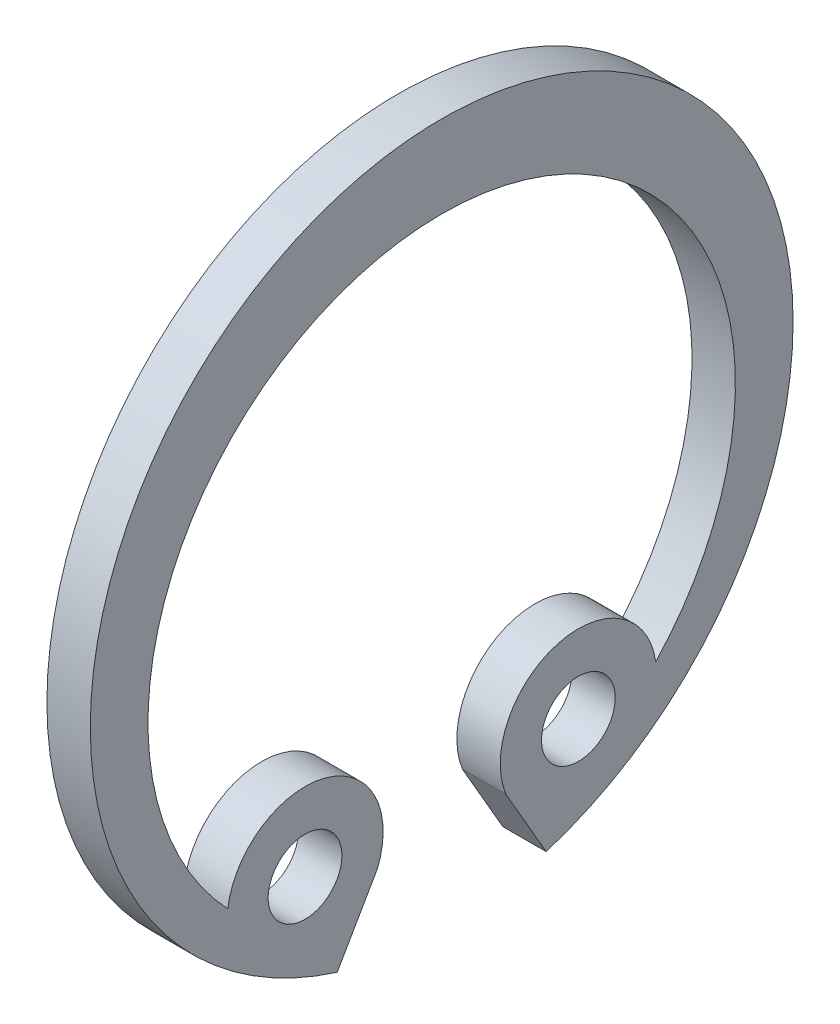
ISO-10303-21;
HEADER;
FILE_DESCRIPTION(('STEP AP214'),'2;1');
FILE_NAME('part.step','',(''),(''),'','','');
FILE_SCHEMA(('AUTOMOTIVE_DESIGN { 1 0 10303 214 1 1 1 1 }'));
ENDSEC;
DATA;
#1=APPLICATION_CONTEXT('core data for automotive mechanical design processes');
#2=APPLICATION_PROTOCOL_DEFINITION('international standard','automotive_design',2000,#1);
#3=PRODUCT_CONTEXT('',#1,'mechanical');
#4=PRODUCT('Part','Part','',(#3));
#5=PRODUCT_RELATED_PRODUCT_CATEGORY('part','',(#4));
#6=PRODUCT_DEFINITION_FORMATION('','',#4);
#7=PRODUCT_DEFINITION_CONTEXT('part definition',#1,'design');
#8=PRODUCT_DEFINITION('design','',#6,#7);
#9=PRODUCT_DEFINITION_SHAPE('','',#8);
#10=(LENGTH_UNIT() NAMED_UNIT(*) SI_UNIT(.MILLI.,.METRE.));
#11=(NAMED_UNIT(*) PLANE_ANGLE_UNIT() SI_UNIT($,.RADIAN.));
#12=(NAMED_UNIT(*) SI_UNIT($,.STERADIAN.) SOLID_ANGLE_UNIT());
#13=UNCERTAINTY_MEASURE_WITH_UNIT(LENGTH_MEASURE(1.E-05),#10,'distance_accuracy_value','');
#14=(GEOMETRIC_REPRESENTATION_CONTEXT(3) GLOBAL_UNCERTAINTY_ASSIGNED_CONTEXT((#13)) GLOBAL_UNIT_ASSIGNED_CONTEXT((#10,
#11,#12)) REPRESENTATION_CONTEXT('',''));
#15=CARTESIAN_POINT('',(0.,0.,0.));
#16=DIRECTION('',(0.,0.,1.));
#17=DIRECTION('',(1.,0.,0.));
#18=AXIS2_PLACEMENT_3D('',#15,#16,#17);
#19=CARTESIAN_POINT('',(0.5,0.,0.));
#20=DIRECTION('',(1.,0.,0.));
#21=DIRECTION('',(0.,0.,-1.));
#22=AXIS2_PLACEMENT_3D('',#19,#20,#21);
#23=PLANE('',#22);
#24=CARTESIAN_POINT('',(0.5,-5.45596004384194,-3.14999999999998));
#25=DIRECTION('',(1.,0.,0.));
#26=DIRECTION('',(0.,0.,-1.));
#27=AXIS2_PLACEMENT_3D('',#24,#25,#26);
#28=CIRCLE('',#27,0.850000000000018);
#29=CARTESIAN_POINT('',(0.5,-5.45596004384194,-4.));
#30=VERTEX_POINT('',#29);
#31=EDGE_CURVE('E122',#30,#30,#28,.T.);
#32=ORIENTED_EDGE('',*,*,#31,.F.);
#33=EDGE_LOOP('',(#32));
#34=FACE_BOUND('',#33,.T.);
#35=CARTESIAN_POINT('',(0.5,0.,0.));
#36=DIRECTION('',(1.,0.,0.));
#37=DIRECTION('',(0.,0.,-1.));
#38=AXIS2_PLACEMENT_3D('',#35,#36,#37);
#39=CIRCLE('',#38,8.09999999999999);
#40=CARTESIAN_POINT('',(0.5,-7.7338013435879,-2.4079694304367));
#41=VERTEX_POINT('',#40);
#42=CARTESIAN_POINT('',(0.5,-7.7338013435879,2.4079694304367));
#43=VERTEX_POINT('',#42);
#44=EDGE_CURVE('E125',#41,#43,#39,.T.);
#45=ORIENTED_EDGE('',*,*,#44,.T.);
#46=DIRECTION('',(0.,0.866025403784439,-0.499999999999998));
#47=VECTOR('',#46,1.);
#48=CARTESIAN_POINT('',(0.5,-7.7338013435879,2.4079694304367));
#49=LINE('',#48,#47);
#50=CARTESIAN_POINT('',(0.5,-6.1240367839042,1.4785714285714));
#51=VERTEX_POINT('',#50);
#52=EDGE_CURVE('E87',#43,#51,#49,.T.);
#53=ORIENTED_EDGE('',*,*,#52,.T.);
#54=CARTESIAN_POINT('',(0.5,-5.45596004384194,3.14999999999998));
#55=DIRECTION('',(1.,0.,0.));
#56=DIRECTION('',(0.,0.,-1.));
#57=AXIS2_PLACEMENT_3D('',#54,#55,#56);
#58=CIRCLE('',#57,1.8);
#59=CARTESIAN_POINT('',(0.5,-5.2069627104098,4.9326946816389));
#60=VERTEX_POINT('',#59);
#61=EDGE_CURVE('E128',#51,#60,#58,.T.);
#62=ORIENTED_EDGE('',*,*,#61,.T.);
#63=CARTESIAN_POINT('',(0.5,-0.569999999999986,0.));
#64=DIRECTION('',(-1.,0.,0.));
#65=DIRECTION('',(0.,0.,1.));
#66=AXIS2_PLACEMENT_3D('',#63,#64,#65);
#67=CIRCLE('',#66,6.76999999999999);
#68=CARTESIAN_POINT('',(0.5,-5.2069627104098,-4.9326946816389));
#69=VERTEX_POINT('',#68);
#70=EDGE_CURVE('E130',#60,#69,#67,.T.);
#71=ORIENTED_EDGE('',*,*,#70,.T.);
#72=CARTESIAN_POINT('',(0.5,-5.45596004384194,-3.14999999999998));
#73=DIRECTION('',(1.,0.,0.));
#74=DIRECTION('',(0.,0.,-1.));
#75=AXIS2_PLACEMENT_3D('',#72,#73,#74);
#76=CIRCLE('',#75,1.8);
#77=CARTESIAN_POINT('',(0.5,-6.1240367839042,-1.4785714285714));
#78=VERTEX_POINT('',#77);
#79=EDGE_CURVE('E51',#69,#78,#76,.T.);
#80=ORIENTED_EDGE('',*,*,#79,.T.);
#81=DIRECTION('',(0.,-0.866025403784439,-0.499999999999998));
#82=VECTOR('',#81,1.);
#83=CARTESIAN_POINT('',(0.5,-6.1240367839042,-1.4785714285714));
#84=LINE('',#83,#82);
#85=EDGE_CURVE('E46',#78,#41,#84,.T.);
#86=ORIENTED_EDGE('',*,*,#85,.T.);
#87=EDGE_LOOP('',(#45,#53,#62,#71,#80,#86));
#88=FACE_BOUND('',#87,.T.);
#89=CARTESIAN_POINT('',(0.5,-5.45596004384194,3.14999999999998));
#90=DIRECTION('',(1.,0.,0.));
#91=DIRECTION('',(0.,0.,-1.));
#92=AXIS2_PLACEMENT_3D('',#89,#90,#91);
#93=CIRCLE('',#92,0.849999999999981);
#94=CARTESIAN_POINT('',(0.5,-5.45596004384194,2.3));
#95=VERTEX_POINT('',#94);
#96=EDGE_CURVE('E119',#95,#95,#93,.T.);
#97=ORIENTED_EDGE('',*,*,#96,.F.);
#98=EDGE_LOOP('',(#97));
#99=FACE_BOUND('',#98,.T.);
#100=ADVANCED_FACE('F31',(#34,#88,#99),#23,.T.);
#101=CARTESIAN_POINT('',(0.5,0.,0.));
#102=DIRECTION('',(-1.,0.,0.));
#103=DIRECTION('',(0.,0.,1.));
#104=AXIS2_PLACEMENT_3D('',#101,#102,#103);
#105=CYLINDRICAL_SURFACE('',#104,8.09999999999999);
#106=DIRECTION('',(-1.,0.,0.));
#107=VECTOR('',#106,1.);
#108=CARTESIAN_POINT('',(0.5,-7.7338013435879,-2.4079694304367));
#109=LINE('',#108,#107);
#110=CARTESIAN_POINT('',(-0.5,-7.7338013435879,-2.4079694304367));
#111=VERTEX_POINT('',#110);
#112=EDGE_CURVE('E102',#41,#111,#109,.T.);
#113=ORIENTED_EDGE('',*,*,#112,.T.);
#114=CARTESIAN_POINT('',(-0.5,0.,0.));
#115=DIRECTION('',(1.,0.,0.));
#116=DIRECTION('',(0.,0.,-1.));
#117=AXIS2_PLACEMENT_3D('',#114,#115,#116);
#118=CIRCLE('',#117,8.09999999999999);
#119=CARTESIAN_POINT('',(-0.5,-7.7338013435879,2.4079694304367));
#120=VERTEX_POINT('',#119);
#121=EDGE_CURVE('E96',#111,#120,#118,.T.);
#122=ORIENTED_EDGE('',*,*,#121,.T.);
#123=DIRECTION('',(-1.,0.,0.));
#124=VECTOR('',#123,1.);
#125=CARTESIAN_POINT('',(0.5,-7.7338013435879,2.4079694304367));
#126=LINE('',#125,#124);
#127=EDGE_CURVE('E11',#43,#120,#126,.T.);
#128=ORIENTED_EDGE('',*,*,#127,.F.);
#129=ORIENTED_EDGE('',*,*,#44,.F.);
#130=EDGE_LOOP('',(#113,#122,#128,#129));
#131=FACE_BOUND('',#130,.T.);
#132=ADVANCED_FACE('F33',(#131),#105,.T.);
#133=CARTESIAN_POINT('',(0.5,-7.7338013435879,2.4079694304367));
#134=DIRECTION('',(0.,0.499999999999999,0.866025403784439));
#135=DIRECTION('',(0.,-0.866025403784439,0.499999999999999));
#136=AXIS2_PLACEMENT_3D('',#133,#134,#135);
#137=PLANE('',#136);
#138=ORIENTED_EDGE('',*,*,#127,.T.);
#139=DIRECTION('',(0.,0.866025403784439,-0.499999999999998));
#140=VECTOR('',#139,1.);
#141=CARTESIAN_POINT('',(-0.5,-7.7338013435879,2.4079694304367));
#142=LINE('',#141,#140);
#143=CARTESIAN_POINT('',(-0.5,-6.1240367839042,1.4785714285714));
#144=VERTEX_POINT('',#143);
#145=EDGE_CURVE('E86',#120,#144,#142,.T.);
#146=ORIENTED_EDGE('',*,*,#145,.T.);
#147=DIRECTION('',(-1.,0.,0.));
#148=VECTOR('',#147,1.);
#149=CARTESIAN_POINT('',(0.5,-6.1240367839042,1.4785714285714));
#150=LINE('',#149,#148);
#151=EDGE_CURVE('E39',#51,#144,#150,.T.);
#152=ORIENTED_EDGE('',*,*,#151,.F.);
#153=ORIENTED_EDGE('',*,*,#52,.F.);
#154=EDGE_LOOP('',(#138,#146,#152,#153));
#155=FACE_BOUND('',#154,.T.);
#156=ADVANCED_FACE('F84',(#155),#137,.F.);
#157=CARTESIAN_POINT('',(0.5,-5.45596004384194,3.14999999999998));
#158=DIRECTION('',(-1.,0.,0.));
#159=DIRECTION('',(0.,0.,1.));
#160=AXIS2_PLACEMENT_3D('',#157,#158,#159);
#161=CYLINDRICAL_SURFACE('',#160,1.8);
#162=ORIENTED_EDGE('',*,*,#151,.T.);
#163=CARTESIAN_POINT('',(-0.5,-5.45596004384194,3.14999999999998));
#164=DIRECTION('',(1.,0.,0.));
#165=DIRECTION('',(0.,0.,-1.));
#166=AXIS2_PLACEMENT_3D('',#163,#164,#165);
#167=CIRCLE('',#166,1.8);
#168=CARTESIAN_POINT('',(-0.5,-5.2069627104098,4.9326946816389));
#169=VERTEX_POINT('',#168);
#170=EDGE_CURVE('E100',#144,#169,#167,.T.);
#171=ORIENTED_EDGE('',*,*,#170,.T.);
#172=DIRECTION('',(-1.,0.,0.));
#173=VECTOR('',#172,1.);
#174=CARTESIAN_POINT('',(0.5,-5.2069627104098,4.9326946816389));
#175=LINE('',#174,#173);
#176=EDGE_CURVE('E139',#60,#169,#175,.T.);
#177=ORIENTED_EDGE('',*,*,#176,.F.);
#178=ORIENTED_EDGE('',*,*,#61,.F.);
#179=EDGE_LOOP('',(#162,#171,#177,#178));
#180=FACE_BOUND('',#179,.T.);
#181=ADVANCED_FACE('F142',(#180),#161,.T.);
#182=CARTESIAN_POINT('',(0.5,-0.569999999999986,0.));
#183=DIRECTION('',(-1.,0.,0.));
#184=DIRECTION('',(0.,0.,1.));
#185=AXIS2_PLACEMENT_3D('',#182,#183,#184);
#186=CYLINDRICAL_SURFACE('',#185,6.76999999999999);
#187=ORIENTED_EDGE('',*,*,#176,.T.);
#188=CARTESIAN_POINT('',(-0.5,-0.569999999999986,0.));
#189=DIRECTION('',(-1.,0.,0.));
#190=DIRECTION('',(0.,0.,1.));
#191=AXIS2_PLACEMENT_3D('',#188,#189,#190);
#192=CIRCLE('',#191,6.76999999999999);
#193=CARTESIAN_POINT('',(-0.5,-5.2069627104098,-4.9326946816389));
#194=VERTEX_POINT('',#193);
#195=EDGE_CURVE('E111',#169,#194,#192,.T.);
#196=ORIENTED_EDGE('',*,*,#195,.T.);
#197=DIRECTION('',(-1.,0.,0.));
#198=VECTOR('',#197,1.);
#199=CARTESIAN_POINT('',(0.5,-5.2069627104098,-4.9326946816389));
#200=LINE('',#199,#198);
#201=EDGE_CURVE('E137',#69,#194,#200,.T.);
#202=ORIENTED_EDGE('',*,*,#201,.F.);
#203=ORIENTED_EDGE('',*,*,#70,.F.);
#204=EDGE_LOOP('',(#187,#196,#202,#203));
#205=FACE_BOUND('',#204,.T.);
#206=ADVANCED_FACE('F148',(#205),#186,.F.);
#207=CARTESIAN_POINT('',(0.5,-5.45596004384194,-3.14999999999998));
#208=DIRECTION('',(-1.,0.,0.));
#209=DIRECTION('',(0.,0.,1.));
#210=AXIS2_PLACEMENT_3D('',#207,#208,#209);
#211=CYLINDRICAL_SURFACE('',#210,1.8);
#212=ORIENTED_EDGE('',*,*,#201,.T.);
#213=CARTESIAN_POINT('',(-0.5,-5.45596004384194,-3.14999999999998));
#214=DIRECTION('',(1.,0.,0.));
#215=DIRECTION('',(0.,0.,-1.));
#216=AXIS2_PLACEMENT_3D('',#213,#214,#215);
#217=CIRCLE('',#216,1.8);
#218=CARTESIAN_POINT('',(-0.5,-6.1240367839042,-1.4785714285714));
#219=VERTEX_POINT('',#218);
#220=EDGE_CURVE('E114',#194,#219,#217,.T.);
#221=ORIENTED_EDGE('',*,*,#220,.T.);
#222=DIRECTION('',(-1.,0.,0.));
#223=VECTOR('',#222,1.);
#224=CARTESIAN_POINT('',(0.5,-6.1240367839042,-1.4785714285714));
#225=LINE('',#224,#223);
#226=EDGE_CURVE('E135',#78,#219,#225,.T.);
#227=ORIENTED_EDGE('',*,*,#226,.F.);
#228=ORIENTED_EDGE('',*,*,#79,.F.);
#229=EDGE_LOOP('',(#212,#221,#227,#228));
#230=FACE_BOUND('',#229,.T.);
#231=ADVANCED_FACE('F151',(#230),#211,.T.);
#232=CARTESIAN_POINT('',(0.5,-6.1240367839042,-1.4785714285714));
#233=DIRECTION('',(0.,0.499999999999999,-0.866025403784439));
#234=DIRECTION('',(0.,0.866025403784439,0.499999999999999));
#235=AXIS2_PLACEMENT_3D('',#232,#233,#234);
#236=PLANE('',#235);
#237=ORIENTED_EDGE('',*,*,#226,.T.);
#238=DIRECTION('',(0.,-0.866025403784439,-0.499999999999998));
#239=VECTOR('',#238,1.);
#240=CARTESIAN_POINT('',(-0.5,-6.1240367839042,-1.4785714285714));
#241=LINE('',#240,#239);
#242=EDGE_CURVE('E117',#219,#111,#241,.T.);
#243=ORIENTED_EDGE('',*,*,#242,.T.);
#244=ORIENTED_EDGE('',*,*,#112,.F.);
#245=ORIENTED_EDGE('',*,*,#85,.F.);
#246=EDGE_LOOP('',(#237,#243,#244,#245));
#247=FACE_BOUND('',#246,.T.);
#248=ADVANCED_FACE('F153',(#247),#236,.F.);
#249=CARTESIAN_POINT('',(0.5,-5.45596004384194,-3.14999999999998));
#250=DIRECTION('',(-1.,0.,0.));
#251=DIRECTION('',(0.,0.,1.));
#252=AXIS2_PLACEMENT_3D('',#249,#250,#251);
#253=CYLINDRICAL_SURFACE('',#252,0.850000000000018);
#254=ORIENTED_EDGE('',*,*,#31,.T.);
#255=EDGE_LOOP('',(#254));
#256=FACE_BOUND('',#255,.T.);
#257=CARTESIAN_POINT('',(-0.5,-5.45596004384194,-3.14999999999998));
#258=DIRECTION('',(1.,0.,0.));
#259=DIRECTION('',(0.,0.,-1.));
#260=AXIS2_PLACEMENT_3D('',#257,#258,#259);
#261=CIRCLE('',#260,0.850000000000018);
#262=CARTESIAN_POINT('',(-0.5,-5.45596004384194,-4.));
#263=VERTEX_POINT('',#262);
#264=EDGE_CURVE('E103',#263,#263,#261,.T.);
#265=ORIENTED_EDGE('',*,*,#264,.F.);
#266=EDGE_LOOP('',(#265));
#267=FACE_BOUND('',#266,.T.);
#268=ADVANCED_FACE('F155',(#256,#267),#253,.F.);
#269=CARTESIAN_POINT('',(0.5,-5.45596004384194,3.14999999999998));
#270=DIRECTION('',(-1.,0.,0.));
#271=DIRECTION('',(0.,0.,1.));
#272=AXIS2_PLACEMENT_3D('',#269,#270,#271);
#273=CYLINDRICAL_SURFACE('',#272,0.849999999999981);
#274=ORIENTED_EDGE('',*,*,#96,.T.);
#275=EDGE_LOOP('',(#274));
#276=FACE_BOUND('',#275,.T.);
#277=CARTESIAN_POINT('',(-0.5,-5.45596004384194,3.14999999999998));
#278=DIRECTION('',(1.,0.,0.));
#279=DIRECTION('',(0.,0.,-1.));
#280=AXIS2_PLACEMENT_3D('',#277,#278,#279);
#281=CIRCLE('',#280,0.849999999999981);
#282=CARTESIAN_POINT('',(-0.5,-5.45596004384194,2.3));
#283=VERTEX_POINT('',#282);
#284=EDGE_CURVE('E106',#283,#283,#281,.T.);
#285=ORIENTED_EDGE('',*,*,#284,.F.);
#286=EDGE_LOOP('',(#285));
#287=FACE_BOUND('',#286,.T.);
#288=ADVANCED_FACE('F161',(#276,#287),#273,.F.);
#289=CARTESIAN_POINT('',(-0.5,0.,0.));
#290=DIRECTION('',(1.,0.,0.));
#291=DIRECTION('',(0.,0.,-1.));
#292=AXIS2_PLACEMENT_3D('',#289,#290,#291);
#293=PLANE('',#292);
#294=ORIENTED_EDGE('',*,*,#284,.T.);
#295=EDGE_LOOP('',(#294));
#296=FACE_BOUND('',#295,.T.);
#297=ORIENTED_EDGE('',*,*,#264,.T.);
#298=EDGE_LOOP('',(#297));
#299=FACE_BOUND('',#298,.T.);
#300=ORIENTED_EDGE('',*,*,#121,.F.);
#301=ORIENTED_EDGE('',*,*,#242,.F.);
#302=ORIENTED_EDGE('',*,*,#220,.F.);
#303=ORIENTED_EDGE('',*,*,#195,.F.);
#304=ORIENTED_EDGE('',*,*,#170,.F.);
#305=ORIENTED_EDGE('',*,*,#145,.F.);
#306=EDGE_LOOP('',(#300,#301,#302,#303,#304,#305));
#307=FACE_BOUND('',#306,.T.);
#308=ADVANCED_FACE('F94',(#296,#299,#307),#293,.F.);
#309=CLOSED_SHELL('',(#100,#132,#156,#181,#206,#231,#248,#268,#288,#308));
#310=MANIFOLD_SOLID_BREP('B2',#309);
#311=ADVANCED_BREP_SHAPE_REPRESENTATION('',(#18,#310),#14);
#312=SHAPE_DEFINITION_REPRESENTATION(#9,#311);
ENDSEC;
END-ISO-10303-21;
